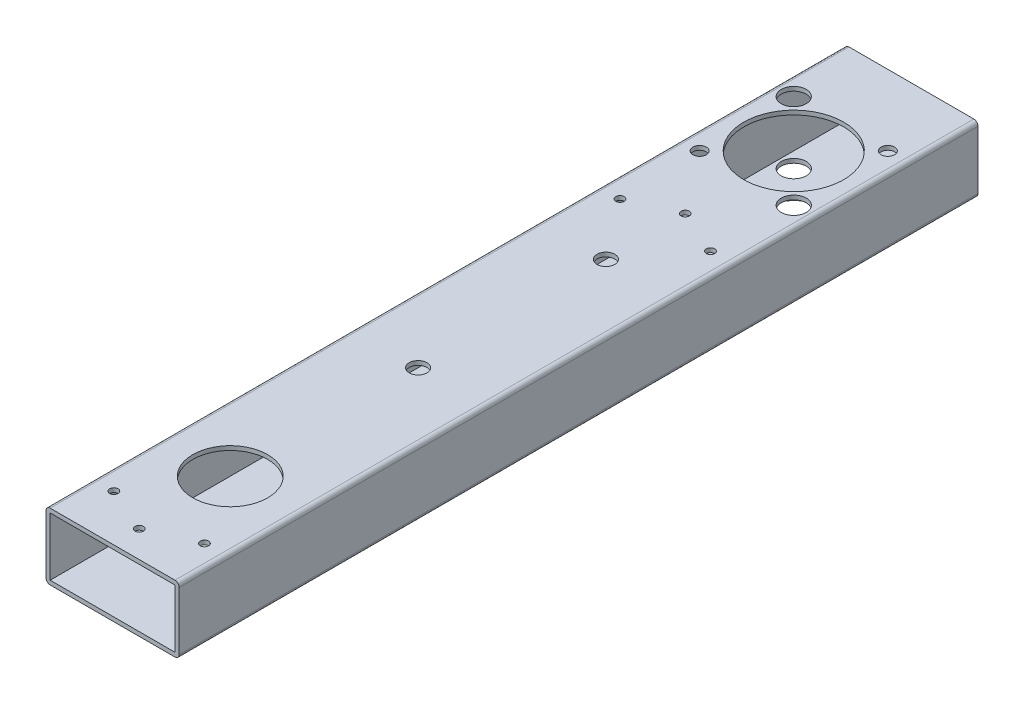
ISO-10303-21;
HEADER;
FILE_DESCRIPTION(('STEP AP214'),'2;1');
FILE_NAME('part.step','',(''),(''),'','','');
FILE_SCHEMA(('AUTOMOTIVE_DESIGN { 1 0 10303 214 1 1 1 1 }'));
ENDSEC;
DATA;
#1=APPLICATION_CONTEXT('core data for automotive mechanical design processes');
#2=APPLICATION_PROTOCOL_DEFINITION('international standard','automotive_design',2000,#1);
#3=PRODUCT_CONTEXT('',#1,'mechanical');
#4=PRODUCT('Part','Part','',(#3));
#5=PRODUCT_RELATED_PRODUCT_CATEGORY('part','',(#4));
#6=PRODUCT_DEFINITION_FORMATION('','',#4);
#7=PRODUCT_DEFINITION_CONTEXT('part definition',#1,'design');
#8=PRODUCT_DEFINITION('design','',#6,#7);
#9=PRODUCT_DEFINITION_SHAPE('','',#8);
#10=(LENGTH_UNIT() NAMED_UNIT(*) SI_UNIT(.MILLI.,.METRE.));
#11=(NAMED_UNIT(*) PLANE_ANGLE_UNIT() SI_UNIT($,.RADIAN.));
#12=(NAMED_UNIT(*) SI_UNIT($,.STERADIAN.) SOLID_ANGLE_UNIT());
#13=UNCERTAINTY_MEASURE_WITH_UNIT(LENGTH_MEASURE(1.E-05),#10,'distance_accuracy_value','');
#14=(GEOMETRIC_REPRESENTATION_CONTEXT(3) GLOBAL_UNCERTAINTY_ASSIGNED_CONTEXT((#13)) GLOBAL_UNIT_ASSIGNED_CONTEXT((#10,
#11,#12)) REPRESENTATION_CONTEXT('',''));
#15=CARTESIAN_POINT('',(0.,0.,0.));
#16=DIRECTION('',(0.,0.,1.));
#17=DIRECTION('',(1.,0.,0.));
#18=AXIS2_PLACEMENT_3D('',#15,#16,#17);
#19=CARTESIAN_POINT('',(-23.8125,-11.1125,304.8));
#20=DIRECTION('',(0.,0.,-1.));
#21=DIRECTION('',(-1.,0.,0.));
#22=AXIS2_PLACEMENT_3D('',#19,#20,#21);
#23=PLANE('',#22);
#24=CARTESIAN_POINT('',(-23.8125,-11.1125,304.8));
#25=DIRECTION('',(0.,0.,1.));
#26=DIRECTION('',(-1.,0.,0.));
#27=AXIS2_PLACEMENT_3D('',#24,#25,#26);
#28=CIRCLE('',#27,1.5875);
#29=CARTESIAN_POINT('',(-25.4,-11.1125,304.8));
#30=VERTEX_POINT('',#29);
#31=CARTESIAN_POINT('',(-23.8125,-12.7,304.8));
#32=VERTEX_POINT('',#31);
#33=EDGE_CURVE('E162',#30,#32,#28,.T.);
#34=ORIENTED_EDGE('',*,*,#33,.T.);
#35=DIRECTION('',(1.,0.,0.));
#36=VECTOR('',#35,1.);
#37=CARTESIAN_POINT('',(-23.8125,-12.7,304.8));
#38=LINE('',#37,#36);
#39=CARTESIAN_POINT('',(23.8125,-12.7,304.8));
#40=VERTEX_POINT('',#39);
#41=EDGE_CURVE('E165',#32,#40,#38,.T.);
#42=ORIENTED_EDGE('',*,*,#41,.T.);
#43=CARTESIAN_POINT('',(23.8125,-11.1125,304.8));
#44=DIRECTION('',(0.,0.,1.));
#45=DIRECTION('',(1.,0.,0.));
#46=AXIS2_PLACEMENT_3D('',#43,#44,#45);
#47=CIRCLE('',#46,1.5875);
#48=CARTESIAN_POINT('',(25.4,-11.1125,304.8));
#49=VERTEX_POINT('',#48);
#50=EDGE_CURVE('E168',#40,#49,#47,.T.);
#51=ORIENTED_EDGE('',*,*,#50,.T.);
#52=DIRECTION('',(0.,1.,0.));
#53=VECTOR('',#52,1.);
#54=CARTESIAN_POINT('',(25.4,-11.1125,304.8));
#55=LINE('',#54,#53);
#56=CARTESIAN_POINT('',(25.4,11.1125,304.8));
#57=VERTEX_POINT('',#56);
#58=EDGE_CURVE('E170',#49,#57,#55,.T.);
#59=ORIENTED_EDGE('',*,*,#58,.T.);
#60=CARTESIAN_POINT('',(23.8125,11.1125,304.8));
#61=DIRECTION('',(0.,0.,1.));
#62=DIRECTION('',(-1.,0.,0.));
#63=AXIS2_PLACEMENT_3D('',#60,#61,#62);
#64=CIRCLE('',#63,1.5875);
#65=CARTESIAN_POINT('',(23.8125,12.7,304.8));
#66=VERTEX_POINT('',#65);
#67=EDGE_CURVE('E172',#57,#66,#64,.T.);
#68=ORIENTED_EDGE('',*,*,#67,.T.);
#69=DIRECTION('',(-1.,0.,0.));
#70=VECTOR('',#69,1.);
#71=CARTESIAN_POINT('',(-23.8125,12.7,304.8));
#72=LINE('',#71,#70);
#73=CARTESIAN_POINT('',(-23.8125,12.7,304.8));
#74=VERTEX_POINT('',#73);
#75=EDGE_CURVE('E174',#66,#74,#72,.T.);
#76=ORIENTED_EDGE('',*,*,#75,.T.);
#77=CARTESIAN_POINT('',(-23.8125,11.1125,304.8));
#78=DIRECTION('',(0.,0.,1.));
#79=DIRECTION('',(-1.,0.,0.));
#80=AXIS2_PLACEMENT_3D('',#77,#78,#79);
#81=CIRCLE('',#80,1.5875);
#82=CARTESIAN_POINT('',(-25.4,11.1125,304.8));
#83=VERTEX_POINT('',#82);
#84=EDGE_CURVE('E176',#74,#83,#81,.T.);
#85=ORIENTED_EDGE('',*,*,#84,.T.);
#86=DIRECTION('',(0.,-1.,0.));
#87=VECTOR('',#86,1.);
#88=CARTESIAN_POINT('',(-25.4,-11.1125,304.8));
#89=LINE('',#88,#87);
#90=EDGE_CURVE('E178',#83,#30,#89,.T.);
#91=ORIENTED_EDGE('',*,*,#90,.T.);
#92=EDGE_LOOP('',(#34,#42,#51,#59,#68,#76,#85,#91));
#93=FACE_BOUND('',#92,.T.);
#94=DIRECTION('',(0.,-1.,0.));
#95=VECTOR('',#94,1.);
#96=CARTESIAN_POINT('',(-23.8125,-11.1125,304.8));
#97=LINE('',#96,#95);
#98=CARTESIAN_POINT('',(-23.8125,11.1125,304.8));
#99=VERTEX_POINT('',#98);
#100=CARTESIAN_POINT('',(-23.8125,-11.1125,304.8));
#101=VERTEX_POINT('',#100);
#102=EDGE_CURVE('E124',#99,#101,#97,.T.);
#103=ORIENTED_EDGE('',*,*,#102,.F.);
#104=DIRECTION('',(-1.,0.,0.));
#105=VECTOR('',#104,1.);
#106=CARTESIAN_POINT('',(-23.8125,11.1125,304.8));
#107=LINE('',#106,#105);
#108=CARTESIAN_POINT('',(23.8125,11.1125,304.8));
#109=VERTEX_POINT('',#108);
#110=EDGE_CURVE('E146',#109,#99,#107,.T.);
#111=ORIENTED_EDGE('',*,*,#110,.F.);
#112=DIRECTION('',(0.,1.,0.));
#113=VECTOR('',#112,1.);
#114=CARTESIAN_POINT('',(23.8125,-11.1125,304.8));
#115=LINE('',#114,#113);
#116=CARTESIAN_POINT('',(23.8125,-11.1125,304.8));
#117=VERTEX_POINT('',#116);
#118=EDGE_CURVE('E144',#117,#109,#115,.T.);
#119=ORIENTED_EDGE('',*,*,#118,.F.);
#120=DIRECTION('',(1.,0.,0.));
#121=VECTOR('',#120,1.);
#122=CARTESIAN_POINT('',(-23.8125,-11.1125,304.8));
#123=LINE('',#122,#121);
#124=EDGE_CURVE('E132',#101,#117,#123,.T.);
#125=ORIENTED_EDGE('',*,*,#124,.F.);
#126=EDGE_LOOP('',(#103,#111,#119,#125));
#127=FACE_BOUND('',#126,.T.);
#128=ADVANCED_FACE('F33',(#93,#127),#23,.F.);
#129=CARTESIAN_POINT('',(-23.8125,-11.1125,0.));
#130=DIRECTION('',(0.,0.,-1.));
#131=DIRECTION('',(-1.,0.,0.));
#132=AXIS2_PLACEMENT_3D('',#129,#130,#131);
#133=PLANE('',#132);
#134=CARTESIAN_POINT('',(-23.8125,-11.1125,0.));
#135=DIRECTION('',(0.,0.,1.));
#136=DIRECTION('',(-1.,0.,0.));
#137=AXIS2_PLACEMENT_3D('',#134,#135,#136);
#138=CIRCLE('',#137,1.5875);
#139=CARTESIAN_POINT('',(-25.4,-11.1125,0.));
#140=VERTEX_POINT('',#139);
#141=CARTESIAN_POINT('',(-23.8125,-12.7,0.));
#142=VERTEX_POINT('',#141);
#143=EDGE_CURVE('E140',#140,#142,#138,.T.);
#144=ORIENTED_EDGE('',*,*,#143,.F.);
#145=DIRECTION('',(0.,-1.,0.));
#146=VECTOR('',#145,1.);
#147=CARTESIAN_POINT('',(-25.4,-11.1125,0.));
#148=LINE('',#147,#146);
#149=CARTESIAN_POINT('',(-25.4,11.1125,0.));
#150=VERTEX_POINT('',#149);
#151=EDGE_CURVE('E166',#150,#140,#148,.T.);
#152=ORIENTED_EDGE('',*,*,#151,.F.);
#153=CARTESIAN_POINT('',(-23.8125,11.1125,0.));
#154=DIRECTION('',(0.,0.,1.));
#155=DIRECTION('',(-1.,0.,0.));
#156=AXIS2_PLACEMENT_3D('',#153,#154,#155);
#157=CIRCLE('',#156,1.5875);
#158=CARTESIAN_POINT('',(-23.8125,12.7,0.));
#159=VERTEX_POINT('',#158);
#160=EDGE_CURVE('E193',#159,#150,#157,.T.);
#161=ORIENTED_EDGE('',*,*,#160,.F.);
#162=DIRECTION('',(-1.,0.,0.));
#163=VECTOR('',#162,1.);
#164=CARTESIAN_POINT('',(-23.8125,12.7,0.));
#165=LINE('',#164,#163);
#166=CARTESIAN_POINT('',(23.8125,12.7,0.));
#167=VERTEX_POINT('',#166);
#168=EDGE_CURVE('E191',#167,#159,#165,.T.);
#169=ORIENTED_EDGE('',*,*,#168,.F.);
#170=CARTESIAN_POINT('',(23.8125,11.1125,0.));
#171=DIRECTION('',(0.,0.,1.));
#172=DIRECTION('',(-1.,0.,0.));
#173=AXIS2_PLACEMENT_3D('',#170,#171,#172);
#174=CIRCLE('',#173,1.5875);
#175=CARTESIAN_POINT('',(25.4,11.1125,0.));
#176=VERTEX_POINT('',#175);
#177=EDGE_CURVE('E189',#176,#167,#174,.T.);
#178=ORIENTED_EDGE('',*,*,#177,.F.);
#179=DIRECTION('',(0.,1.,0.));
#180=VECTOR('',#179,1.);
#181=CARTESIAN_POINT('',(25.4,-11.1125,0.));
#182=LINE('',#181,#180);
#183=CARTESIAN_POINT('',(25.4,-11.1125,0.));
#184=VERTEX_POINT('',#183);
#185=EDGE_CURVE('E187',#184,#176,#182,.T.);
#186=ORIENTED_EDGE('',*,*,#185,.F.);
#187=CARTESIAN_POINT('',(23.8125,-11.1125,0.));
#188=DIRECTION('',(0.,0.,1.));
#189=DIRECTION('',(1.,0.,0.));
#190=AXIS2_PLACEMENT_3D('',#187,#188,#189);
#191=CIRCLE('',#190,1.5875);
#192=CARTESIAN_POINT('',(23.8125,-12.7,0.));
#193=VERTEX_POINT('',#192);
#194=EDGE_CURVE('E185',#193,#184,#191,.T.);
#195=ORIENTED_EDGE('',*,*,#194,.F.);
#196=DIRECTION('',(1.,0.,0.));
#197=VECTOR('',#196,1.);
#198=CARTESIAN_POINT('',(-23.8125,-12.7,0.));
#199=LINE('',#198,#197);
#200=EDGE_CURVE('E183',#142,#193,#199,.T.);
#201=ORIENTED_EDGE('',*,*,#200,.F.);
#202=EDGE_LOOP('',(#144,#152,#161,#169,#178,#186,#195,#201));
#203=FACE_BOUND('',#202,.T.);
#204=DIRECTION('',(-1.,0.,0.));
#205=VECTOR('',#204,1.);
#206=CARTESIAN_POINT('',(-23.8125,11.1125,0.));
#207=LINE('',#206,#205);
#208=CARTESIAN_POINT('',(23.8125,11.1125,0.));
#209=VERTEX_POINT('',#208);
#210=CARTESIAN_POINT('',(-23.8125,11.1125,0.));
#211=VERTEX_POINT('',#210);
#212=EDGE_CURVE('E133',#209,#211,#207,.T.);
#213=ORIENTED_EDGE('',*,*,#212,.T.);
#214=DIRECTION('',(0.,-1.,0.));
#215=VECTOR('',#214,1.);
#216=CARTESIAN_POINT('',(-23.8125,-11.1125,0.));
#217=LINE('',#216,#215);
#218=CARTESIAN_POINT('',(-23.8125,-11.1125,0.));
#219=VERTEX_POINT('',#218);
#220=EDGE_CURVE('E58',#211,#219,#217,.T.);
#221=ORIENTED_EDGE('',*,*,#220,.T.);
#222=DIRECTION('',(1.,0.,0.));
#223=VECTOR('',#222,1.);
#224=CARTESIAN_POINT('',(-23.8125,-11.1125,0.));
#225=LINE('',#224,#223);
#226=CARTESIAN_POINT('',(23.8125,-11.1125,0.));
#227=VERTEX_POINT('',#226);
#228=EDGE_CURVE('E139',#219,#227,#225,.T.);
#229=ORIENTED_EDGE('',*,*,#228,.T.);
#230=DIRECTION('',(0.,1.,0.));
#231=VECTOR('',#230,1.);
#232=CARTESIAN_POINT('',(23.8125,-11.1125,0.));
#233=LINE('',#232,#231);
#234=EDGE_CURVE('E154',#227,#209,#233,.T.);
#235=ORIENTED_EDGE('',*,*,#234,.T.);
#236=EDGE_LOOP('',(#213,#221,#229,#235));
#237=FACE_BOUND('',#236,.T.);
#238=ADVANCED_FACE('F286',(#203,#237),#133,.T.);
#239=CARTESIAN_POINT('',(-23.8125,-11.1125,304.8));
#240=DIRECTION('',(0.,0.,-1.));
#241=DIRECTION('',(-1.,0.,0.));
#242=AXIS2_PLACEMENT_3D('',#239,#240,#241);
#243=CYLINDRICAL_SURFACE('',#242,1.5875);
#244=ORIENTED_EDGE('',*,*,#143,.T.);
#245=DIRECTION('',(0.,0.,-1.));
#246=VECTOR('',#245,1.);
#247=CARTESIAN_POINT('',(-23.8125,-12.7,304.8));
#248=LINE('',#247,#246);
#249=EDGE_CURVE('E11',#32,#142,#248,.T.);
#250=ORIENTED_EDGE('',*,*,#249,.F.);
#251=ORIENTED_EDGE('',*,*,#33,.F.);
#252=DIRECTION('',(0.,0.,-1.));
#253=VECTOR('',#252,1.);
#254=CARTESIAN_POINT('',(-25.4,-11.1125,304.8));
#255=LINE('',#254,#253);
#256=EDGE_CURVE('E180',#30,#140,#255,.T.);
#257=ORIENTED_EDGE('',*,*,#256,.T.);
#258=EDGE_LOOP('',(#244,#250,#251,#257));
#259=FACE_BOUND('',#258,.T.);
#260=ADVANCED_FACE('F35',(#259),#243,.T.);
#261=CARTESIAN_POINT('',(-23.8125,-12.7,304.8));
#262=DIRECTION('',(0.,1.,0.));
#263=DIRECTION('',(0.,0.,1.));
#264=AXIS2_PLACEMENT_3D('',#261,#262,#263);
#265=PLANE('',#264);
#266=CARTESIAN_POINT('',(0.,-12.7,116.566667182));
#267=DIRECTION('',(0.,1.,0.));
#268=DIRECTION('',(0.,0.,1.));
#269=AXIS2_PLACEMENT_3D('',#266,#267,#268);
#270=CIRCLE('',#269,7.93750000000001);
#271=CARTESIAN_POINT('',(0.,-12.7,124.504167182));
#272=VERTEX_POINT('',#271);
#273=EDGE_CURVE('E675',#272,#272,#270,.F.);
#274=ORIENTED_EDGE('',*,*,#273,.F.);
#275=EDGE_LOOP('',(#274));
#276=FACE_BOUND('',#275,.T.);
#277=CARTESIAN_POINT('',(0.,-12.7,188.233332818));
#278=DIRECTION('',(0.,1.,0.));
#279=DIRECTION('',(0.,0.,1.));
#280=AXIS2_PLACEMENT_3D('',#277,#278,#279);
#281=CIRCLE('',#280,7.9375);
#282=CARTESIAN_POINT('',(0.,-12.7,196.170832818));
#283=VERTEX_POINT('',#282);
#284=EDGE_CURVE('E671',#283,#283,#281,.F.);
#285=ORIENTED_EDGE('',*,*,#284,.F.);
#286=EDGE_LOOP('',(#285));
#287=FACE_BOUND('',#286,.T.);
#288=CARTESIAN_POINT('',(-17.960512242139,-12.7,26.9394877578611));
#289=DIRECTION('',(0.,-1.,0.));
#290=DIRECTION('',(1.,0.,0.));
#291=AXIS2_PLACEMENT_3D('',#288,#289,#290);
#292=CIRCLE('',#291,4.76249999999982);
#293=CARTESIAN_POINT('',(-13.1980122421392,-12.7,26.9394877578611));
#294=VERTEX_POINT('',#293);
#295=EDGE_CURVE('E690',#294,#294,#292,.T.);
#296=ORIENTED_EDGE('',*,*,#295,.F.);
#297=EDGE_LOOP('',(#296));
#298=FACE_BOUND('',#297,.T.);
#299=CARTESIAN_POINT('',(17.9605122421392,-12.7,62.860512242139));
#300=DIRECTION('',(0.,-1.,0.));
#301=DIRECTION('',(1.,0.,0.));
#302=AXIS2_PLACEMENT_3D('',#299,#300,#301);
#303=CIRCLE('',#302,4.76249999999983);
#304=CARTESIAN_POINT('',(22.7230122421391,-12.7,62.860512242139));
#305=VERTEX_POINT('',#304);
#306=EDGE_CURVE('E699',#305,#305,#303,.T.);
#307=ORIENTED_EDGE('',*,*,#306,.F.);
#308=EDGE_LOOP('',(#307));
#309=FACE_BOUND('',#308,.T.);
#310=CARTESIAN_POINT('',(-17.9605122421387,-12.7,62.8605122421392));
#311=DIRECTION('',(0.,-1.,0.));
#312=DIRECTION('',(1.,0.,0.));
#313=AXIS2_PLACEMENT_3D('',#310,#311,#312);
#314=CIRCLE('',#313,2.5527);
#315=CARTESIAN_POINT('',(-15.4078122421387,-12.7,62.8605122421392));
#316=VERTEX_POINT('',#315);
#317=EDGE_CURVE('E691',#316,#316,#314,.T.);
#318=ORIENTED_EDGE('',*,*,#317,.F.);
#319=EDGE_LOOP('',(#318));
#320=FACE_BOUND('',#319,.T.);
#321=CARTESIAN_POINT('',(17.9605122421391,-12.7,26.9394877578609));
#322=DIRECTION('',(0.,-1.,0.));
#323=DIRECTION('',(1.,0.,0.));
#324=AXIS2_PLACEMENT_3D('',#321,#322,#323);
#325=CIRCLE('',#324,2.5527);
#326=CARTESIAN_POINT('',(20.5132122421391,-12.7,26.9394877578609));
#327=VERTEX_POINT('',#326);
#328=EDGE_CURVE('E698',#327,#327,#325,.T.);
#329=ORIENTED_EDGE('',*,*,#328,.F.);
#330=EDGE_LOOP('',(#329));
#331=FACE_BOUND('',#330,.T.);
#332=CARTESIAN_POINT('',(0.,-12.7,44.9));
#333=DIRECTION('',(0.,1.,0.));
#334=DIRECTION('',(0.,0.,1.));
#335=AXIS2_PLACEMENT_3D('',#332,#333,#334);
#336=CIRCLE('',#335,12.7);
#337=CARTESIAN_POINT('',(0.,-12.7,57.6));
#338=VERTEX_POINT('',#337);
#339=EDGE_CURVE('E249',#338,#338,#336,.F.);
#340=ORIENTED_EDGE('',*,*,#339,.F.);
#341=EDGE_LOOP('',(#340));
#342=FACE_BOUND('',#341,.T.);
#343=CARTESIAN_POINT('',(0.,-12.7,259.9));
#344=DIRECTION('',(0.,1.,0.));
#345=DIRECTION('',(0.,0.,1.));
#346=AXIS2_PLACEMENT_3D('',#343,#344,#345);
#347=CIRCLE('',#346,12.7);
#348=CARTESIAN_POINT('',(0.,-12.7,272.6));
#349=VERTEX_POINT('',#348);
#350=EDGE_CURVE('E244',#349,#349,#347,.F.);
#351=ORIENTED_EDGE('',*,*,#350,.F.);
#352=EDGE_LOOP('',(#351));
#353=FACE_BOUND('',#352,.T.);
#354=ORIENTED_EDGE('',*,*,#200,.T.);
#355=DIRECTION('',(0.,0.,-1.));
#356=VECTOR('',#355,1.);
#357=CARTESIAN_POINT('',(23.8125,-12.7,304.8));
#358=LINE('',#357,#356);
#359=EDGE_CURVE('E42',#40,#193,#358,.T.);
#360=ORIENTED_EDGE('',*,*,#359,.F.);
#361=ORIENTED_EDGE('',*,*,#41,.F.);
#362=ORIENTED_EDGE('',*,*,#249,.T.);
#363=EDGE_LOOP('',(#354,#360,#361,#362));
#364=FACE_BOUND('',#363,.T.);
#365=ADVANCED_FACE('F310',(#276,#287,#298,#309,#320,#331,#342,#353,#364),#265,.F.);
#366=CARTESIAN_POINT('',(23.8125,-11.1125,304.8));
#367=DIRECTION('',(0.,0.,-1.));
#368=DIRECTION('',(-1.,0.,0.));
#369=AXIS2_PLACEMENT_3D('',#366,#367,#368);
#370=CYLINDRICAL_SURFACE('',#369,1.5875);
#371=ORIENTED_EDGE('',*,*,#194,.T.);
#372=DIRECTION('',(0.,0.,-1.));
#373=VECTOR('',#372,1.);
#374=CARTESIAN_POINT('',(25.4,-11.1125,304.8));
#375=LINE('',#374,#373);
#376=EDGE_CURVE('E210',#49,#184,#375,.T.);
#377=ORIENTED_EDGE('',*,*,#376,.F.);
#378=ORIENTED_EDGE('',*,*,#50,.F.);
#379=ORIENTED_EDGE('',*,*,#359,.T.);
#380=EDGE_LOOP('',(#371,#377,#378,#379));
#381=FACE_BOUND('',#380,.T.);
#382=ADVANCED_FACE('F308',(#381),#370,.T.);
#383=CARTESIAN_POINT('',(25.4,-11.1125,304.8));
#384=DIRECTION('',(-1.,0.,0.));
#385=DIRECTION('',(0.,0.,1.));
#386=AXIS2_PLACEMENT_3D('',#383,#384,#385);
#387=PLANE('',#386);
#388=ORIENTED_EDGE('',*,*,#185,.T.);
#389=DIRECTION('',(0.,0.,-1.));
#390=VECTOR('',#389,1.);
#391=CARTESIAN_POINT('',(25.4,11.1125,304.8));
#392=LINE('',#391,#390);
#393=EDGE_CURVE('E207',#57,#176,#392,.T.);
#394=ORIENTED_EDGE('',*,*,#393,.F.);
#395=ORIENTED_EDGE('',*,*,#58,.F.);
#396=ORIENTED_EDGE('',*,*,#376,.T.);
#397=EDGE_LOOP('',(#388,#394,#395,#396));
#398=FACE_BOUND('',#397,.T.);
#399=ADVANCED_FACE('F304',(#398),#387,.F.);
#400=CARTESIAN_POINT('',(23.8125,11.1125,304.8));
#401=DIRECTION('',(0.,0.,-1.));
#402=DIRECTION('',(-1.,0.,0.));
#403=AXIS2_PLACEMENT_3D('',#400,#401,#402);
#404=CYLINDRICAL_SURFACE('',#403,1.5875);
#405=ORIENTED_EDGE('',*,*,#177,.T.);
#406=DIRECTION('',(0.,0.,-1.));
#407=VECTOR('',#406,1.);
#408=CARTESIAN_POINT('',(23.8125,12.7,304.8));
#409=LINE('',#408,#407);
#410=EDGE_CURVE('E204',#66,#167,#409,.T.);
#411=ORIENTED_EDGE('',*,*,#410,.F.);
#412=ORIENTED_EDGE('',*,*,#67,.F.);
#413=ORIENTED_EDGE('',*,*,#393,.T.);
#414=EDGE_LOOP('',(#405,#411,#412,#413));
#415=FACE_BOUND('',#414,.T.);
#416=ADVANCED_FACE('F269',(#415),#404,.T.);
#417=CARTESIAN_POINT('',(-23.8125,12.7,304.8));
#418=DIRECTION('',(0.,-1.,0.));
#419=DIRECTION('',(0.,0.,-1.));
#420=AXIS2_PLACEMENT_3D('',#417,#418,#419);
#421=PLANE('',#420);
#422=CARTESIAN_POINT('',(-17.272,12.7,287.02));
#423=DIRECTION('',(0.,-1.,0.));
#424=DIRECTION('',(0.,0.,-1.));
#425=AXIS2_PLACEMENT_3D('',#422,#423,#424);
#426=CIRCLE('',#425,1.58750000000002);
#427=CARTESIAN_POINT('',(-17.272,12.7,285.4325));
#428=VERTEX_POINT('',#427);
#429=EDGE_CURVE('E658',#428,#428,#426,.F.);
#430=ORIENTED_EDGE('',*,*,#429,.F.);
#431=EDGE_LOOP('',(#430));
#432=FACE_BOUND('',#431,.T.);
#433=CARTESIAN_POINT('',(0.,12.7,294.64));
#434=DIRECTION('',(0.,-1.,0.));
#435=DIRECTION('',(0.,0.,-1.));
#436=AXIS2_PLACEMENT_3D('',#433,#434,#435);
#437=CIRCLE('',#436,1.58750000000002);
#438=CARTESIAN_POINT('',(0.,12.7,293.0525));
#439=VERTEX_POINT('',#438);
#440=EDGE_CURVE('E660',#439,#439,#437,.F.);
#441=ORIENTED_EDGE('',*,*,#440,.F.);
#442=EDGE_LOOP('',(#441));
#443=FACE_BOUND('',#442,.T.);
#444=CARTESIAN_POINT('',(17.2720000000001,12.7,93.9220000000009));
#445=DIRECTION('',(0.,-1.,0.));
#446=DIRECTION('',(0.,0.,-1.));
#447=AXIS2_PLACEMENT_3D('',#444,#445,#446);
#448=CIRCLE('',#447,1.5875000000005);
#449=CARTESIAN_POINT('',(17.2720000000001,12.7,92.3345000000004));
#450=VERTEX_POINT('',#449);
#451=EDGE_CURVE('E666',#450,#450,#448,.F.);
#452=ORIENTED_EDGE('',*,*,#451,.F.);
#453=EDGE_LOOP('',(#452));
#454=FACE_BOUND('',#453,.T.);
#455=CARTESIAN_POINT('',(0.,12.7,86.3020000000009));
#456=DIRECTION('',(0.,-1.,0.));
#457=DIRECTION('',(0.,0.,-1.));
#458=AXIS2_PLACEMENT_3D('',#455,#456,#457);
#459=CIRCLE('',#458,1.5875000000005);
#460=CARTESIAN_POINT('',(0.,12.7,84.7145000000004));
#461=VERTEX_POINT('',#460);
#462=EDGE_CURVE('E785',#461,#461,#459,.F.);
#463=ORIENTED_EDGE('',*,*,#462,.F.);
#464=EDGE_LOOP('',(#463));
#465=FACE_BOUND('',#464,.T.);
#466=CARTESIAN_POINT('',(-17.272,12.7,93.9220000000009));
#467=DIRECTION('',(0.,-1.,0.));
#468=DIRECTION('',(0.,0.,-1.));
#469=AXIS2_PLACEMENT_3D('',#466,#467,#468);
#470=CIRCLE('',#469,1.58750000000049);
#471=CARTESIAN_POINT('',(-17.272,12.7,92.3345000000004));
#472=VERTEX_POINT('',#471);
#473=EDGE_CURVE('E788',#472,#472,#470,.F.);
#474=ORIENTED_EDGE('',*,*,#473,.F.);
#475=EDGE_LOOP('',(#474));
#476=FACE_BOUND('',#475,.T.);
#477=CARTESIAN_POINT('',(17.272,12.7,287.02));
#478=DIRECTION('',(0.,-1.,0.));
#479=DIRECTION('',(0.,0.,-1.));
#480=AXIS2_PLACEMENT_3D('',#477,#478,#479);
#481=CIRCLE('',#480,1.58750000000002);
#482=CARTESIAN_POINT('',(17.272,12.7,285.4325));
#483=VERTEX_POINT('',#482);
#484=EDGE_CURVE('E791',#483,#483,#481,.F.);
#485=ORIENTED_EDGE('',*,*,#484,.F.);
#486=EDGE_LOOP('',(#485));
#487=FACE_BOUND('',#486,.T.);
#488=CARTESIAN_POINT('',(0.,12.7,116.566667182));
#489=DIRECTION('',(0.,-1.,0.));
#490=DIRECTION('',(0.,0.,-1.));
#491=AXIS2_PLACEMENT_3D('',#488,#489,#490);
#492=CIRCLE('',#491,3.37819999999999);
#493=CARTESIAN_POINT('',(0.,12.7,113.188467182));
#494=VERTEX_POINT('',#493);
#495=EDGE_CURVE('E687',#494,#494,#492,.F.);
#496=ORIENTED_EDGE('',*,*,#495,.F.);
#497=EDGE_LOOP('',(#496));
#498=FACE_BOUND('',#497,.T.);
#499=CARTESIAN_POINT('',(0.,12.7,188.233332818));
#500=DIRECTION('',(0.,-1.,0.));
#501=DIRECTION('',(0.,0.,-1.));
#502=AXIS2_PLACEMENT_3D('',#499,#500,#501);
#503=CIRCLE('',#502,3.37819999999999);
#504=CARTESIAN_POINT('',(0.,12.7,184.855132818));
#505=VERTEX_POINT('',#504);
#506=EDGE_CURVE('E682',#505,#505,#503,.F.);
#507=ORIENTED_EDGE('',*,*,#506,.F.);
#508=EDGE_LOOP('',(#507));
#509=FACE_BOUND('',#508,.T.);
#510=CARTESIAN_POINT('',(-17.960512242139,12.7,26.9394877578611));
#511=DIRECTION('',(0.,-1.,0.));
#512=DIRECTION('',(1.,0.,0.));
#513=AXIS2_PLACEMENT_3D('',#510,#511,#512);
#514=CIRCLE('',#513,4.76249999999982);
#515=CARTESIAN_POINT('',(-13.1980122421392,12.7,26.9394877578611));
#516=VERTEX_POINT('',#515);
#517=EDGE_CURVE('E702',#516,#516,#514,.T.);
#518=ORIENTED_EDGE('',*,*,#517,.T.);
#519=EDGE_LOOP('',(#518));
#520=FACE_BOUND('',#519,.T.);
#521=CARTESIAN_POINT('',(17.9605122421392,12.7,62.860512242139));
#522=DIRECTION('',(0.,-1.,0.));
#523=DIRECTION('',(1.,0.,0.));
#524=AXIS2_PLACEMENT_3D('',#521,#522,#523);
#525=CIRCLE('',#524,4.76249999999983);
#526=CARTESIAN_POINT('',(22.7230122421391,12.7,62.860512242139));
#527=VERTEX_POINT('',#526);
#528=EDGE_CURVE('E695',#527,#527,#525,.T.);
#529=ORIENTED_EDGE('',*,*,#528,.T.);
#530=EDGE_LOOP('',(#529));
#531=FACE_BOUND('',#530,.T.);
#532=CARTESIAN_POINT('',(-17.9605122421387,12.7,62.8605122421392));
#533=DIRECTION('',(0.,-1.,0.));
#534=DIRECTION('',(1.,0.,0.));
#535=AXIS2_PLACEMENT_3D('',#532,#533,#534);
#536=CIRCLE('',#535,2.5527);
#537=CARTESIAN_POINT('',(-15.4078122421387,12.7,62.8605122421392));
#538=VERTEX_POINT('',#537);
#539=EDGE_CURVE('E694',#538,#538,#536,.T.);
#540=ORIENTED_EDGE('',*,*,#539,.T.);
#541=EDGE_LOOP('',(#540));
#542=FACE_BOUND('',#541,.T.);
#543=CARTESIAN_POINT('',(17.9605122421391,12.7,26.9394877578609));
#544=DIRECTION('',(0.,-1.,0.));
#545=DIRECTION('',(1.,0.,0.));
#546=AXIS2_PLACEMENT_3D('',#543,#544,#545);
#547=CIRCLE('',#546,2.5527);
#548=CARTESIAN_POINT('',(20.5132122421391,12.7,26.9394877578609));
#549=VERTEX_POINT('',#548);
#550=EDGE_CURVE('E219',#549,#549,#547,.T.);
#551=ORIENTED_EDGE('',*,*,#550,.T.);
#552=EDGE_LOOP('',(#551));
#553=FACE_BOUND('',#552,.T.);
#554=CARTESIAN_POINT('',(0.,12.7,259.9));
#555=DIRECTION('',(0.,-1.,0.));
#556=DIRECTION('',(0.,0.,-1.));
#557=AXIS2_PLACEMENT_3D('',#554,#555,#556);
#558=CIRCLE('',#557,14.2875);
#559=CARTESIAN_POINT('',(0.,12.7,245.6125));
#560=VERTEX_POINT('',#559);
#561=EDGE_CURVE('E152',#560,#560,#558,.F.);
#562=ORIENTED_EDGE('',*,*,#561,.F.);
#563=EDGE_LOOP('',(#562));
#564=FACE_BOUND('',#563,.T.);
#565=CARTESIAN_POINT('',(0.,12.7,44.9));
#566=DIRECTION('',(0.,-1.,0.));
#567=DIRECTION('',(0.,0.,-1.));
#568=AXIS2_PLACEMENT_3D('',#565,#566,#567);
#569=CIRCLE('',#568,19.05);
#570=CARTESIAN_POINT('',(0.,12.7,25.85));
#571=VERTEX_POINT('',#570);
#572=EDGE_CURVE('E256',#571,#571,#569,.F.);
#573=ORIENTED_EDGE('',*,*,#572,.F.);
#574=EDGE_LOOP('',(#573));
#575=FACE_BOUND('',#574,.T.);
#576=ORIENTED_EDGE('',*,*,#168,.T.);
#577=DIRECTION('',(0.,0.,-1.));
#578=VECTOR('',#577,1.);
#579=CARTESIAN_POINT('',(-23.8125,12.7,304.8));
#580=LINE('',#579,#578);
#581=EDGE_CURVE('E201',#74,#159,#580,.T.);
#582=ORIENTED_EDGE('',*,*,#581,.F.);
#583=ORIENTED_EDGE('',*,*,#75,.F.);
#584=ORIENTED_EDGE('',*,*,#410,.T.);
#585=EDGE_LOOP('',(#576,#582,#583,#584));
#586=FACE_BOUND('',#585,.T.);
#587=ADVANCED_FACE('F265',(#432,#443,#454,#465,#476,#487,#498,#509,#520,#531,#542,#553,#564,
#575,#586),#421,.F.);
#588=CARTESIAN_POINT('',(-23.8125,11.1125,304.8));
#589=DIRECTION('',(0.,0.,-1.));
#590=DIRECTION('',(-1.,0.,0.));
#591=AXIS2_PLACEMENT_3D('',#588,#589,#590);
#592=CYLINDRICAL_SURFACE('',#591,1.5875);
#593=ORIENTED_EDGE('',*,*,#160,.T.);
#594=DIRECTION('',(0.,0.,-1.));
#595=VECTOR('',#594,1.);
#596=CARTESIAN_POINT('',(-25.4,11.1125,304.8));
#597=LINE('',#596,#595);
#598=EDGE_CURVE('E198',#83,#150,#597,.T.);
#599=ORIENTED_EDGE('',*,*,#598,.F.);
#600=ORIENTED_EDGE('',*,*,#84,.F.);
#601=ORIENTED_EDGE('',*,*,#581,.T.);
#602=EDGE_LOOP('',(#593,#599,#600,#601));
#603=FACE_BOUND('',#602,.T.);
#604=ADVANCED_FACE('F268',(#603),#592,.T.);
#605=CARTESIAN_POINT('',(-25.4,-11.1125,304.8));
#606=DIRECTION('',(1.,0.,0.));
#607=DIRECTION('',(0.,0.,-1.));
#608=AXIS2_PLACEMENT_3D('',#605,#606,#607);
#609=PLANE('',#608);
#610=ORIENTED_EDGE('',*,*,#151,.T.);
#611=ORIENTED_EDGE('',*,*,#256,.F.);
#612=ORIENTED_EDGE('',*,*,#90,.F.);
#613=ORIENTED_EDGE('',*,*,#598,.T.);
#614=EDGE_LOOP('',(#610,#611,#612,#613));
#615=FACE_BOUND('',#614,.T.);
#616=ADVANCED_FACE('F290',(#615),#609,.F.);
#617=CARTESIAN_POINT('',(-23.8125,-11.1125,304.8));
#618=DIRECTION('',(1.,0.,0.));
#619=DIRECTION('',(0.,0.,-1.));
#620=AXIS2_PLACEMENT_3D('',#617,#618,#619);
#621=PLANE('',#620);
#622=ORIENTED_EDGE('',*,*,#220,.F.);
#623=DIRECTION('',(0.,0.,-1.));
#624=VECTOR('',#623,1.);
#625=CARTESIAN_POINT('',(-23.8125,11.1125,304.8));
#626=LINE('',#625,#624);
#627=EDGE_CURVE('E128',#99,#211,#626,.T.);
#628=ORIENTED_EDGE('',*,*,#627,.F.);
#629=ORIENTED_EDGE('',*,*,#102,.T.);
#630=DIRECTION('',(0.,0.,-1.));
#631=VECTOR('',#630,1.);
#632=CARTESIAN_POINT('',(-23.8125,-11.1125,304.8));
#633=LINE('',#632,#631);
#634=EDGE_CURVE('E127',#101,#219,#633,.T.);
#635=ORIENTED_EDGE('',*,*,#634,.T.);
#636=EDGE_LOOP('',(#622,#628,#629,#635));
#637=FACE_BOUND('',#636,.T.);
#638=ADVANCED_FACE('F126',(#637),#621,.T.);
#639=CARTESIAN_POINT('',(-23.8125,-11.1125,304.8));
#640=DIRECTION('',(0.,1.,0.));
#641=DIRECTION('',(0.,0.,1.));
#642=AXIS2_PLACEMENT_3D('',#639,#640,#641);
#643=PLANE('',#642);
#644=CARTESIAN_POINT('',(0.,-11.1125,116.566667182));
#645=DIRECTION('',(0.,1.,0.));
#646=DIRECTION('',(0.,0.,1.));
#647=AXIS2_PLACEMENT_3D('',#644,#645,#646);
#648=CIRCLE('',#647,7.93750000000001);
#649=CARTESIAN_POINT('',(0.,-11.1125,124.504167182));
#650=VERTEX_POINT('',#649);
#651=EDGE_CURVE('E663',#650,#650,#648,.F.);
#652=ORIENTED_EDGE('',*,*,#651,.T.);
#653=EDGE_LOOP('',(#652));
#654=FACE_BOUND('',#653,.T.);
#655=CARTESIAN_POINT('',(0.,-11.1125,188.233332818));
#656=DIRECTION('',(0.,1.,0.));
#657=DIRECTION('',(0.,0.,1.));
#658=AXIS2_PLACEMENT_3D('',#655,#656,#657);
#659=CIRCLE('',#658,7.9375);
#660=CARTESIAN_POINT('',(0.,-11.1125,196.170832818));
#661=VERTEX_POINT('',#660);
#662=EDGE_CURVE('E659',#661,#661,#659,.F.);
#663=ORIENTED_EDGE('',*,*,#662,.T.);
#664=EDGE_LOOP('',(#663));
#665=FACE_BOUND('',#664,.T.);
#666=CARTESIAN_POINT('',(-17.960512242139,-11.1125,26.9394877578611));
#667=DIRECTION('',(0.,1.,0.));
#668=DIRECTION('',(0.,0.,1.));
#669=AXIS2_PLACEMENT_3D('',#666,#667,#668);
#670=CIRCLE('',#669,4.76249999999982);
#671=CARTESIAN_POINT('',(-17.960512242139,-11.1125,31.7019877578609));
#672=VERTEX_POINT('',#671);
#673=EDGE_CURVE('E237',#672,#672,#670,.T.);
#674=ORIENTED_EDGE('',*,*,#673,.F.);
#675=EDGE_LOOP('',(#674));
#676=FACE_BOUND('',#675,.T.);
#677=CARTESIAN_POINT('',(17.9605122421392,-11.1125,62.860512242139));
#678=DIRECTION('',(0.,1.,0.));
#679=DIRECTION('',(0.,0.,1.));
#680=AXIS2_PLACEMENT_3D('',#677,#678,#679);
#681=CIRCLE('',#680,4.76249999999983);
#682=CARTESIAN_POINT('',(17.9605122421392,-11.1125,67.6230122421388));
#683=VERTEX_POINT('',#682);
#684=EDGE_CURVE('E225',#683,#683,#681,.T.);
#685=ORIENTED_EDGE('',*,*,#684,.F.);
#686=EDGE_LOOP('',(#685));
#687=FACE_BOUND('',#686,.T.);
#688=CARTESIAN_POINT('',(-17.9605122421387,-11.1125,62.8605122421392));
#689=DIRECTION('',(0.,1.,0.));
#690=DIRECTION('',(0.,0.,1.));
#691=AXIS2_PLACEMENT_3D('',#688,#689,#690);
#692=CIRCLE('',#691,2.5527);
#693=CARTESIAN_POINT('',(-17.9605122421387,-11.1125,65.4132122421392));
#694=VERTEX_POINT('',#693);
#695=EDGE_CURVE('E222',#694,#694,#692,.T.);
#696=ORIENTED_EDGE('',*,*,#695,.F.);
#697=EDGE_LOOP('',(#696));
#698=FACE_BOUND('',#697,.T.);
#699=CARTESIAN_POINT('',(17.9605122421391,-11.1125,26.9394877578609));
#700=DIRECTION('',(0.,1.,0.));
#701=DIRECTION('',(0.,0.,1.));
#702=AXIS2_PLACEMENT_3D('',#699,#700,#701);
#703=CIRCLE('',#702,2.5527);
#704=CARTESIAN_POINT('',(17.9605122421391,-11.1125,29.4921877578609));
#705=VERTEX_POINT('',#704);
#706=EDGE_CURVE('E218',#705,#705,#703,.T.);
#707=ORIENTED_EDGE('',*,*,#706,.F.);
#708=EDGE_LOOP('',(#707));
#709=FACE_BOUND('',#708,.T.);
#710=CARTESIAN_POINT('',(0.,-11.1125,44.9));
#711=DIRECTION('',(0.,1.,0.));
#712=DIRECTION('',(0.,0.,1.));
#713=AXIS2_PLACEMENT_3D('',#710,#711,#712);
#714=CIRCLE('',#713,12.7);
#715=CARTESIAN_POINT('',(0.,-11.1125,57.6));
#716=VERTEX_POINT('',#715);
#717=EDGE_CURVE('E241',#716,#716,#714,.F.);
#718=ORIENTED_EDGE('',*,*,#717,.T.);
#719=EDGE_LOOP('',(#718));
#720=FACE_BOUND('',#719,.T.);
#721=CARTESIAN_POINT('',(0.,-11.1125,259.9));
#722=DIRECTION('',(0.,1.,0.));
#723=DIRECTION('',(0.,0.,1.));
#724=AXIS2_PLACEMENT_3D('',#721,#722,#723);
#725=CIRCLE('',#724,12.7);
#726=CARTESIAN_POINT('',(0.,-11.1125,272.6));
#727=VERTEX_POINT('',#726);
#728=EDGE_CURVE('E240',#727,#727,#725,.F.);
#729=ORIENTED_EDGE('',*,*,#728,.T.);
#730=EDGE_LOOP('',(#729));
#731=FACE_BOUND('',#730,.T.);
#732=ORIENTED_EDGE('',*,*,#228,.F.);
#733=ORIENTED_EDGE('',*,*,#634,.F.);
#734=ORIENTED_EDGE('',*,*,#124,.T.);
#735=DIRECTION('',(0.,0.,-1.));
#736=VECTOR('',#735,1.);
#737=CARTESIAN_POINT('',(23.8125,-11.1125,304.8));
#738=LINE('',#737,#736);
#739=EDGE_CURVE('E141',#117,#227,#738,.T.);
#740=ORIENTED_EDGE('',*,*,#739,.T.);
#741=EDGE_LOOP('',(#732,#733,#734,#740));
#742=FACE_BOUND('',#741,.T.);
#743=ADVANCED_FACE('F136',(#654,#665,#676,#687,#698,#709,#720,#731,#742),#643,.T.);
#744=CARTESIAN_POINT('',(23.8125,-11.1125,304.8));
#745=DIRECTION('',(-1.,0.,0.));
#746=DIRECTION('',(0.,-1.,0.));
#747=AXIS2_PLACEMENT_3D('',#744,#745,#746);
#748=PLANE('',#747);
#749=ORIENTED_EDGE('',*,*,#234,.F.);
#750=ORIENTED_EDGE('',*,*,#739,.F.);
#751=ORIENTED_EDGE('',*,*,#118,.T.);
#752=DIRECTION('',(0.,0.,-1.));
#753=VECTOR('',#752,1.);
#754=CARTESIAN_POINT('',(23.8125,11.1125,304.8));
#755=LINE('',#754,#753);
#756=EDGE_CURVE('E50',#109,#209,#755,.T.);
#757=ORIENTED_EDGE('',*,*,#756,.T.);
#758=EDGE_LOOP('',(#749,#750,#751,#757));
#759=FACE_BOUND('',#758,.T.);
#760=ADVANCED_FACE('F370',(#759),#748,.T.);
#761=CARTESIAN_POINT('',(-23.8125,11.1125,304.8));
#762=DIRECTION('',(0.,-1.,0.));
#763=DIRECTION('',(1.,0.,0.));
#764=AXIS2_PLACEMENT_3D('',#761,#762,#763);
#765=PLANE('',#764);
#766=CARTESIAN_POINT('',(-17.272,11.1125,287.02));
#767=DIRECTION('',(0.,-1.,0.));
#768=DIRECTION('',(1.,0.,0.));
#769=AXIS2_PLACEMENT_3D('',#766,#767,#768);
#770=CIRCLE('',#769,1.58750000000002);
#771=CARTESIAN_POINT('',(-15.6845,11.1125,287.02));
#772=VERTEX_POINT('',#771);
#773=EDGE_CURVE('E655',#772,#772,#770,.F.);
#774=ORIENTED_EDGE('',*,*,#773,.T.);
#775=EDGE_LOOP('',(#774));
#776=FACE_BOUND('',#775,.T.);
#777=CARTESIAN_POINT('',(0.,11.1125,294.64));
#778=DIRECTION('',(0.,-1.,0.));
#779=DIRECTION('',(1.,0.,0.));
#780=AXIS2_PLACEMENT_3D('',#777,#778,#779);
#781=CIRCLE('',#780,1.58750000000002);
#782=CARTESIAN_POINT('',(1.58750000000002,11.1125,294.64));
#783=VERTEX_POINT('',#782);
#784=EDGE_CURVE('E804',#783,#783,#781,.F.);
#785=ORIENTED_EDGE('',*,*,#784,.T.);
#786=EDGE_LOOP('',(#785));
#787=FACE_BOUND('',#786,.T.);
#788=CARTESIAN_POINT('',(17.2720000000001,11.1125,93.9220000000009));
#789=DIRECTION('',(0.,-1.,0.));
#790=DIRECTION('',(1.,0.,0.));
#791=AXIS2_PLACEMENT_3D('',#788,#789,#790);
#792=CIRCLE('',#791,1.5875000000005);
#793=CARTESIAN_POINT('',(18.8595000000006,11.1125,93.9220000000009));
#794=VERTEX_POINT('',#793);
#795=EDGE_CURVE('E800',#794,#794,#792,.F.);
#796=ORIENTED_EDGE('',*,*,#795,.T.);
#797=EDGE_LOOP('',(#796));
#798=FACE_BOUND('',#797,.T.);
#799=CARTESIAN_POINT('',(0.,11.1125,86.3020000000009));
#800=DIRECTION('',(0.,-1.,0.));
#801=DIRECTION('',(1.,0.,0.));
#802=AXIS2_PLACEMENT_3D('',#799,#800,#801);
#803=CIRCLE('',#802,1.5875000000005);
#804=CARTESIAN_POINT('',(1.58750000000055,11.1125,86.3020000000009));
#805=VERTEX_POINT('',#804);
#806=EDGE_CURVE('E797',#805,#805,#803,.F.);
#807=ORIENTED_EDGE('',*,*,#806,.T.);
#808=EDGE_LOOP('',(#807));
#809=FACE_BOUND('',#808,.T.);
#810=CARTESIAN_POINT('',(-17.272,11.1125,93.9220000000009));
#811=DIRECTION('',(0.,-1.,0.));
#812=DIRECTION('',(1.,0.,0.));
#813=AXIS2_PLACEMENT_3D('',#810,#811,#812);
#814=CIRCLE('',#813,1.58750000000049);
#815=CARTESIAN_POINT('',(-15.6844999999995,11.1125,93.9220000000009));
#816=VERTEX_POINT('',#815);
#817=EDGE_CURVE('E801',#816,#816,#814,.F.);
#818=ORIENTED_EDGE('',*,*,#817,.T.);
#819=EDGE_LOOP('',(#818));
#820=FACE_BOUND('',#819,.T.);
#821=CARTESIAN_POINT('',(17.272,11.1125,287.02));
#822=DIRECTION('',(0.,-1.,0.));
#823=DIRECTION('',(1.,0.,0.));
#824=AXIS2_PLACEMENT_3D('',#821,#822,#823);
#825=CIRCLE('',#824,1.58750000000002);
#826=CARTESIAN_POINT('',(18.8595,11.1125,287.02));
#827=VERTEX_POINT('',#826);
#828=EDGE_CURVE('E794',#827,#827,#825,.F.);
#829=ORIENTED_EDGE('',*,*,#828,.T.);
#830=EDGE_LOOP('',(#829));
#831=FACE_BOUND('',#830,.T.);
#832=CARTESIAN_POINT('',(0.,11.1125,116.566667182));
#833=DIRECTION('',(0.,-1.,0.));
#834=DIRECTION('',(1.,0.,0.));
#835=AXIS2_PLACEMENT_3D('',#832,#833,#834);
#836=CIRCLE('',#835,3.37819999999999);
#837=CARTESIAN_POINT('',(3.3782,11.1125,116.566667182));
#838=VERTEX_POINT('',#837);
#839=EDGE_CURVE('E679',#838,#838,#836,.F.);
#840=ORIENTED_EDGE('',*,*,#839,.T.);
#841=EDGE_LOOP('',(#840));
#842=FACE_BOUND('',#841,.T.);
#843=CARTESIAN_POINT('',(0.,11.1125,188.233332818));
#844=DIRECTION('',(0.,-1.,0.));
#845=DIRECTION('',(1.,0.,0.));
#846=AXIS2_PLACEMENT_3D('',#843,#844,#845);
#847=CIRCLE('',#846,3.37819999999999);
#848=CARTESIAN_POINT('',(3.37820000000001,11.1125,188.233332818));
#849=VERTEX_POINT('',#848);
#850=EDGE_CURVE('E678',#849,#849,#847,.F.);
#851=ORIENTED_EDGE('',*,*,#850,.T.);
#852=EDGE_LOOP('',(#851));
#853=FACE_BOUND('',#852,.T.);
#854=CARTESIAN_POINT('',(-17.960512242139,11.1125,26.9394877578611));
#855=DIRECTION('',(0.,-1.,0.));
#856=DIRECTION('',(1.,0.,0.));
#857=AXIS2_PLACEMENT_3D('',#854,#855,#856);
#858=CIRCLE('',#857,4.76249999999982);
#859=CARTESIAN_POINT('',(-13.1980122421392,11.1125,26.9394877578611));
#860=VERTEX_POINT('',#859);
#861=EDGE_CURVE('E37',#860,#860,#858,.T.);
#862=ORIENTED_EDGE('',*,*,#861,.F.);
#863=EDGE_LOOP('',(#862));
#864=FACE_BOUND('',#863,.T.);
#865=CARTESIAN_POINT('',(17.9605122421392,11.1125,62.860512242139));
#866=DIRECTION('',(0.,-1.,0.));
#867=DIRECTION('',(1.,0.,0.));
#868=AXIS2_PLACEMENT_3D('',#865,#866,#867);
#869=CIRCLE('',#868,4.76249999999983);
#870=CARTESIAN_POINT('',(22.7230122421391,11.1125,62.860512242139));
#871=VERTEX_POINT('',#870);
#872=EDGE_CURVE('E223',#871,#871,#869,.T.);
#873=ORIENTED_EDGE('',*,*,#872,.F.);
#874=EDGE_LOOP('',(#873));
#875=FACE_BOUND('',#874,.T.);
#876=CARTESIAN_POINT('',(-17.9605122421387,11.1125,62.8605122421392));
#877=DIRECTION('',(0.,-1.,0.));
#878=DIRECTION('',(1.,0.,0.));
#879=AXIS2_PLACEMENT_3D('',#876,#877,#878);
#880=CIRCLE('',#879,2.5527);
#881=CARTESIAN_POINT('',(-15.4078122421387,11.1125,62.8605122421392));
#882=VERTEX_POINT('',#881);
#883=EDGE_CURVE('E220',#882,#882,#880,.T.);
#884=ORIENTED_EDGE('',*,*,#883,.F.);
#885=EDGE_LOOP('',(#884));
#886=FACE_BOUND('',#885,.T.);
#887=CARTESIAN_POINT('',(17.9605122421391,11.1125,26.9394877578609));
#888=DIRECTION('',(0.,-1.,0.));
#889=DIRECTION('',(1.,0.,0.));
#890=AXIS2_PLACEMENT_3D('',#887,#888,#889);
#891=CIRCLE('',#890,2.5527);
#892=CARTESIAN_POINT('',(20.5132122421391,11.1125,26.9394877578609));
#893=VERTEX_POINT('',#892);
#894=EDGE_CURVE('E215',#893,#893,#891,.T.);
#895=ORIENTED_EDGE('',*,*,#894,.F.);
#896=EDGE_LOOP('',(#895));
#897=FACE_BOUND('',#896,.T.);
#898=CARTESIAN_POINT('',(0.,11.1125,259.9));
#899=DIRECTION('',(0.,-1.,0.));
#900=DIRECTION('',(1.,0.,0.));
#901=AXIS2_PLACEMENT_3D('',#898,#899,#900);
#902=CIRCLE('',#901,14.2875);
#903=CARTESIAN_POINT('',(14.2875,11.1125,259.9));
#904=VERTEX_POINT('',#903);
#905=EDGE_CURVE('E253',#904,#904,#902,.F.);
#906=ORIENTED_EDGE('',*,*,#905,.T.);
#907=EDGE_LOOP('',(#906));
#908=FACE_BOUND('',#907,.T.);
#909=CARTESIAN_POINT('',(0.,11.1125,44.9));
#910=DIRECTION('',(0.,-1.,0.));
#911=DIRECTION('',(1.,0.,0.));
#912=AXIS2_PLACEMENT_3D('',#909,#910,#911);
#913=CIRCLE('',#912,19.05);
#914=CARTESIAN_POINT('',(19.05,11.1125,44.9));
#915=VERTEX_POINT('',#914);
#916=EDGE_CURVE('E252',#915,#915,#913,.F.);
#917=ORIENTED_EDGE('',*,*,#916,.T.);
#918=EDGE_LOOP('',(#917));
#919=FACE_BOUND('',#918,.T.);
#920=ORIENTED_EDGE('',*,*,#212,.F.);
#921=ORIENTED_EDGE('',*,*,#756,.F.);
#922=ORIENTED_EDGE('',*,*,#110,.T.);
#923=ORIENTED_EDGE('',*,*,#627,.T.);
#924=EDGE_LOOP('',(#920,#921,#922,#923));
#925=FACE_BOUND('',#924,.T.);
#926=ADVANCED_FACE('F377',(#776,#787,#798,#809,#820,#831,#842,#853,#864,#875,#886,#897,#908,
#919,#925),#765,.T.);
#927=CARTESIAN_POINT('',(0.,12.700012,44.9));
#928=DIRECTION('',(0.,-1.,0.));
#929=DIRECTION('',(0.,0.,-1.));
#930=AXIS2_PLACEMENT_3D('',#927,#928,#929);
#931=CYLINDRICAL_SURFACE('',#930,19.05);
#932=ORIENTED_EDGE('',*,*,#916,.F.);
#933=EDGE_LOOP('',(#932));
#934=FACE_BOUND('',#933,.T.);
#935=ORIENTED_EDGE('',*,*,#572,.T.);
#936=EDGE_LOOP('',(#935));
#937=FACE_BOUND('',#936,.T.);
#938=ADVANCED_FACE('F385',(#934,#937),#931,.F.);
#939=CARTESIAN_POINT('',(0.,12.700012,259.9));
#940=DIRECTION('',(0.,-1.,0.));
#941=DIRECTION('',(0.,0.,-1.));
#942=AXIS2_PLACEMENT_3D('',#939,#940,#941);
#943=CYLINDRICAL_SURFACE('',#942,14.2875);
#944=ORIENTED_EDGE('',*,*,#905,.F.);
#945=EDGE_LOOP('',(#944));
#946=FACE_BOUND('',#945,.T.);
#947=ORIENTED_EDGE('',*,*,#561,.T.);
#948=EDGE_LOOP('',(#947));
#949=FACE_BOUND('',#948,.T.);
#950=ADVANCED_FACE('F263',(#946,#949),#943,.F.);
#951=CARTESIAN_POINT('',(0.,-12.700012,259.9));
#952=DIRECTION('',(0.,1.,0.));
#953=DIRECTION('',(0.,0.,1.));
#954=AXIS2_PLACEMENT_3D('',#951,#952,#953);
#955=CYLINDRICAL_SURFACE('',#954,12.7);
#956=ORIENTED_EDGE('',*,*,#728,.F.);
#957=EDGE_LOOP('',(#956));
#958=FACE_BOUND('',#957,.T.);
#959=ORIENTED_EDGE('',*,*,#350,.T.);
#960=EDGE_LOOP('',(#959));
#961=FACE_BOUND('',#960,.T.);
#962=ADVANCED_FACE('F400',(#958,#961),#955,.F.);
#963=CARTESIAN_POINT('',(0.,-12.700012,44.9));
#964=DIRECTION('',(0.,1.,0.));
#965=DIRECTION('',(0.,0.,1.));
#966=AXIS2_PLACEMENT_3D('',#963,#964,#965);
#967=CYLINDRICAL_SURFACE('',#966,12.7);
#968=ORIENTED_EDGE('',*,*,#717,.F.);
#969=EDGE_LOOP('',(#968));
#970=FACE_BOUND('',#969,.T.);
#971=ORIENTED_EDGE('',*,*,#339,.T.);
#972=EDGE_LOOP('',(#971));
#973=FACE_BOUND('',#972,.T.);
#974=ADVANCED_FACE('F408',(#970,#973),#967,.F.);
#975=CARTESIAN_POINT('',(17.9605122421391,12.7,26.9394877578609));
#976=DIRECTION('',(0.,-1.,0.));
#977=DIRECTION('',(1.,0.,0.));
#978=AXIS2_PLACEMENT_3D('',#975,#976,#977);
#979=CYLINDRICAL_SURFACE('',#978,2.5527);
#980=ORIENTED_EDGE('',*,*,#894,.T.);
#981=EDGE_LOOP('',(#980));
#982=FACE_BOUND('',#981,.T.);
#983=ORIENTED_EDGE('',*,*,#550,.F.);
#984=EDGE_LOOP('',(#983));
#985=FACE_BOUND('',#984,.T.);
#986=ADVANCED_FACE('F416',(#982,#985),#979,.F.);
#987=CARTESIAN_POINT('',(-17.9605122421387,12.7,62.8605122421392));
#988=DIRECTION('',(0.,-1.,0.));
#989=DIRECTION('',(1.,0.,0.));
#990=AXIS2_PLACEMENT_3D('',#987,#988,#989);
#991=CYLINDRICAL_SURFACE('',#990,2.5527);
#992=ORIENTED_EDGE('',*,*,#883,.T.);
#993=EDGE_LOOP('',(#992));
#994=FACE_BOUND('',#993,.T.);
#995=ORIENTED_EDGE('',*,*,#539,.F.);
#996=EDGE_LOOP('',(#995));
#997=FACE_BOUND('',#996,.T.);
#998=ADVANCED_FACE('F424',(#994,#997),#991,.F.);
#999=CARTESIAN_POINT('',(17.9605122421392,12.7,62.860512242139));
#1000=DIRECTION('',(0.,-1.,0.));
#1001=DIRECTION('',(1.,0.,0.));
#1002=AXIS2_PLACEMENT_3D('',#999,#1000,#1001);
#1003=CYLINDRICAL_SURFACE('',#1002,4.76249999999983);
#1004=ORIENTED_EDGE('',*,*,#872,.T.);
#1005=EDGE_LOOP('',(#1004));
#1006=FACE_BOUND('',#1005,.T.);
#1007=ORIENTED_EDGE('',*,*,#528,.F.);
#1008=EDGE_LOOP('',(#1007));
#1009=FACE_BOUND('',#1008,.T.);
#1010=ADVANCED_FACE('F433',(#1006,#1009),#1003,.F.);
#1011=CARTESIAN_POINT('',(-17.960512242139,12.7,26.9394877578611));
#1012=DIRECTION('',(0.,-1.,0.));
#1013=DIRECTION('',(1.,0.,0.));
#1014=AXIS2_PLACEMENT_3D('',#1011,#1012,#1013);
#1015=CYLINDRICAL_SURFACE('',#1014,4.76249999999982);
#1016=ORIENTED_EDGE('',*,*,#861,.T.);
#1017=EDGE_LOOP('',(#1016));
#1018=FACE_BOUND('',#1017,.T.);
#1019=ORIENTED_EDGE('',*,*,#517,.F.);
#1020=EDGE_LOOP('',(#1019));
#1021=FACE_BOUND('',#1020,.T.);
#1022=ADVANCED_FACE('F442',(#1018,#1021),#1015,.F.);
#1023=ORIENTED_EDGE('',*,*,#706,.T.);
#1024=EDGE_LOOP('',(#1023));
#1025=FACE_BOUND('',#1024,.T.);
#1026=ORIENTED_EDGE('',*,*,#328,.T.);
#1027=EDGE_LOOP('',(#1026));
#1028=FACE_BOUND('',#1027,.T.);
#1029=ADVANCED_FACE('F427',(#1025,#1028),#979,.F.);
#1030=ORIENTED_EDGE('',*,*,#695,.T.);
#1031=EDGE_LOOP('',(#1030));
#1032=FACE_BOUND('',#1031,.T.);
#1033=ORIENTED_EDGE('',*,*,#317,.T.);
#1034=EDGE_LOOP('',(#1033));
#1035=FACE_BOUND('',#1034,.T.);
#1036=ADVANCED_FACE('F436',(#1032,#1035),#991,.F.);
#1037=ORIENTED_EDGE('',*,*,#684,.T.);
#1038=EDGE_LOOP('',(#1037));
#1039=FACE_BOUND('',#1038,.T.);
#1040=ORIENTED_EDGE('',*,*,#306,.T.);
#1041=EDGE_LOOP('',(#1040));
#1042=FACE_BOUND('',#1041,.T.);
#1043=ADVANCED_FACE('F444',(#1039,#1042),#1003,.F.);
#1044=ORIENTED_EDGE('',*,*,#673,.T.);
#1045=EDGE_LOOP('',(#1044));
#1046=FACE_BOUND('',#1045,.T.);
#1047=ORIENTED_EDGE('',*,*,#295,.T.);
#1048=EDGE_LOOP('',(#1047));
#1049=FACE_BOUND('',#1048,.T.);
#1050=ADVANCED_FACE('F452',(#1046,#1049),#1015,.F.);
#1051=CARTESIAN_POINT('',(0.,12.700012,188.233332818));
#1052=DIRECTION('',(0.,-1.,0.));
#1053=DIRECTION('',(0.,0.,-1.));
#1054=AXIS2_PLACEMENT_3D('',#1051,#1052,#1053);
#1055=CYLINDRICAL_SURFACE('',#1054,3.37819999999999);
#1056=ORIENTED_EDGE('',*,*,#850,.F.);
#1057=EDGE_LOOP('',(#1056));
#1058=FACE_BOUND('',#1057,.T.);
#1059=ORIENTED_EDGE('',*,*,#506,.T.);
#1060=EDGE_LOOP('',(#1059));
#1061=FACE_BOUND('',#1060,.T.);
#1062=ADVANCED_FACE('F475',(#1058,#1061),#1055,.F.);
#1063=CARTESIAN_POINT('',(0.,12.700012,116.566667182));
#1064=DIRECTION('',(0.,-1.,0.));
#1065=DIRECTION('',(0.,0.,-1.));
#1066=AXIS2_PLACEMENT_3D('',#1063,#1064,#1065);
#1067=CYLINDRICAL_SURFACE('',#1066,3.37819999999999);
#1068=ORIENTED_EDGE('',*,*,#839,.F.);
#1069=EDGE_LOOP('',(#1068));
#1070=FACE_BOUND('',#1069,.T.);
#1071=ORIENTED_EDGE('',*,*,#495,.T.);
#1072=EDGE_LOOP('',(#1071));
#1073=FACE_BOUND('',#1072,.T.);
#1074=ADVANCED_FACE('F482',(#1070,#1073),#1067,.F.);
#1075=CARTESIAN_POINT('',(0.,-12.700012,188.233332818));
#1076=DIRECTION('',(0.,1.,0.));
#1077=DIRECTION('',(0.,0.,1.));
#1078=AXIS2_PLACEMENT_3D('',#1075,#1076,#1077);
#1079=CYLINDRICAL_SURFACE('',#1078,7.9375);
#1080=ORIENTED_EDGE('',*,*,#662,.F.);
#1081=EDGE_LOOP('',(#1080));
#1082=FACE_BOUND('',#1081,.T.);
#1083=ORIENTED_EDGE('',*,*,#284,.T.);
#1084=EDGE_LOOP('',(#1083));
#1085=FACE_BOUND('',#1084,.T.);
#1086=ADVANCED_FACE('F490',(#1082,#1085),#1079,.F.);
#1087=CARTESIAN_POINT('',(0.,-12.700012,116.566667182));
#1088=DIRECTION('',(0.,1.,0.));
#1089=DIRECTION('',(0.,0.,1.));
#1090=AXIS2_PLACEMENT_3D('',#1087,#1088,#1089);
#1091=CYLINDRICAL_SURFACE('',#1090,7.93750000000001);
#1092=ORIENTED_EDGE('',*,*,#651,.F.);
#1093=EDGE_LOOP('',(#1092));
#1094=FACE_BOUND('',#1093,.T.);
#1095=ORIENTED_EDGE('',*,*,#273,.T.);
#1096=EDGE_LOOP('',(#1095));
#1097=FACE_BOUND('',#1096,.T.);
#1098=ADVANCED_FACE('F497',(#1094,#1097),#1091,.F.);
#1099=CARTESIAN_POINT('',(17.272,12.700012,287.02));
#1100=DIRECTION('',(0.,-1.,0.));
#1101=DIRECTION('',(0.,0.,-1.));
#1102=AXIS2_PLACEMENT_3D('',#1099,#1100,#1101);
#1103=CYLINDRICAL_SURFACE('',#1102,1.58750000000002);
#1104=ORIENTED_EDGE('',*,*,#828,.F.);
#1105=EDGE_LOOP('',(#1104));
#1106=FACE_BOUND('',#1105,.T.);
#1107=ORIENTED_EDGE('',*,*,#484,.T.);
#1108=EDGE_LOOP('',(#1107));
#1109=FACE_BOUND('',#1108,.T.);
#1110=ADVANCED_FACE('F504',(#1106,#1109),#1103,.F.);
#1111=CARTESIAN_POINT('',(-17.272,12.700012,93.9220000000009));
#1112=DIRECTION('',(0.,-1.,0.));
#1113=DIRECTION('',(0.,0.,-1.));
#1114=AXIS2_PLACEMENT_3D('',#1111,#1112,#1113);
#1115=CYLINDRICAL_SURFACE('',#1114,1.58750000000049);
#1116=ORIENTED_EDGE('',*,*,#817,.F.);
#1117=EDGE_LOOP('',(#1116));
#1118=FACE_BOUND('',#1117,.T.);
#1119=ORIENTED_EDGE('',*,*,#473,.T.);
#1120=EDGE_LOOP('',(#1119));
#1121=FACE_BOUND('',#1120,.T.);
#1122=ADVANCED_FACE('F511',(#1118,#1121),#1115,.F.);
#1123=CARTESIAN_POINT('',(0.,12.700012,86.3020000000009));
#1124=DIRECTION('',(0.,-1.,0.));
#1125=DIRECTION('',(0.,0.,-1.));
#1126=AXIS2_PLACEMENT_3D('',#1123,#1124,#1125);
#1127=CYLINDRICAL_SURFACE('',#1126,1.5875000000005);
#1128=ORIENTED_EDGE('',*,*,#806,.F.);
#1129=EDGE_LOOP('',(#1128));
#1130=FACE_BOUND('',#1129,.T.);
#1131=ORIENTED_EDGE('',*,*,#462,.T.);
#1132=EDGE_LOOP('',(#1131));
#1133=FACE_BOUND('',#1132,.T.);
#1134=ADVANCED_FACE('F519',(#1130,#1133),#1127,.F.);
#1135=CARTESIAN_POINT('',(17.2720000000001,12.700012,93.9220000000009));
#1136=DIRECTION('',(0.,-1.,0.));
#1137=DIRECTION('',(0.,0.,-1.));
#1138=AXIS2_PLACEMENT_3D('',#1135,#1136,#1137);
#1139=CYLINDRICAL_SURFACE('',#1138,1.5875000000005);
#1140=ORIENTED_EDGE('',*,*,#795,.F.);
#1141=EDGE_LOOP('',(#1140));
#1142=FACE_BOUND('',#1141,.T.);
#1143=ORIENTED_EDGE('',*,*,#451,.T.);
#1144=EDGE_LOOP('',(#1143));
#1145=FACE_BOUND('',#1144,.T.);
#1146=ADVANCED_FACE('F527',(#1142,#1145),#1139,.F.);
#1147=CARTESIAN_POINT('',(0.,12.700012,294.64));
#1148=DIRECTION('',(0.,-1.,0.));
#1149=DIRECTION('',(0.,0.,-1.));
#1150=AXIS2_PLACEMENT_3D('',#1147,#1148,#1149);
#1151=CYLINDRICAL_SURFACE('',#1150,1.58750000000002);
#1152=ORIENTED_EDGE('',*,*,#784,.F.);
#1153=EDGE_LOOP('',(#1152));
#1154=FACE_BOUND('',#1153,.T.);
#1155=ORIENTED_EDGE('',*,*,#440,.T.);
#1156=EDGE_LOOP('',(#1155));
#1157=FACE_BOUND('',#1156,.T.);
#1158=ADVANCED_FACE('F535',(#1154,#1157),#1151,.F.);
#1159=CARTESIAN_POINT('',(-17.272,12.700012,287.02));
#1160=DIRECTION('',(0.,-1.,0.));
#1161=DIRECTION('',(0.,0.,-1.));
#1162=AXIS2_PLACEMENT_3D('',#1159,#1160,#1161);
#1163=CYLINDRICAL_SURFACE('',#1162,1.58750000000002);
#1164=ORIENTED_EDGE('',*,*,#773,.F.);
#1165=EDGE_LOOP('',(#1164));
#1166=FACE_BOUND('',#1165,.T.);
#1167=ORIENTED_EDGE('',*,*,#429,.T.);
#1168=EDGE_LOOP('',(#1167));
#1169=FACE_BOUND('',#1168,.T.);
#1170=ADVANCED_FACE('F543',(#1166,#1169),#1163,.F.);
#1171=CLOSED_SHELL('',(#128,#238,#260,#365,#382,#399,#416,#587,#604,#616,#638,#743,#760,#926,
#938,#950,#962,#974,#986,#998,#1010,#1022,#1029,#1036,#1043,#1050,#1062,#1074,#1086,#1098,#1110,
#1122,#1134,#1146,#1158,#1170));
#1172=MANIFOLD_SOLID_BREP('B2',#1171);
#1173=ADVANCED_BREP_SHAPE_REPRESENTATION('',(#18,#1172),#14);
#1174=SHAPE_DEFINITION_REPRESENTATION(#9,#1173);
ENDSEC;
END-ISO-10303-21;
